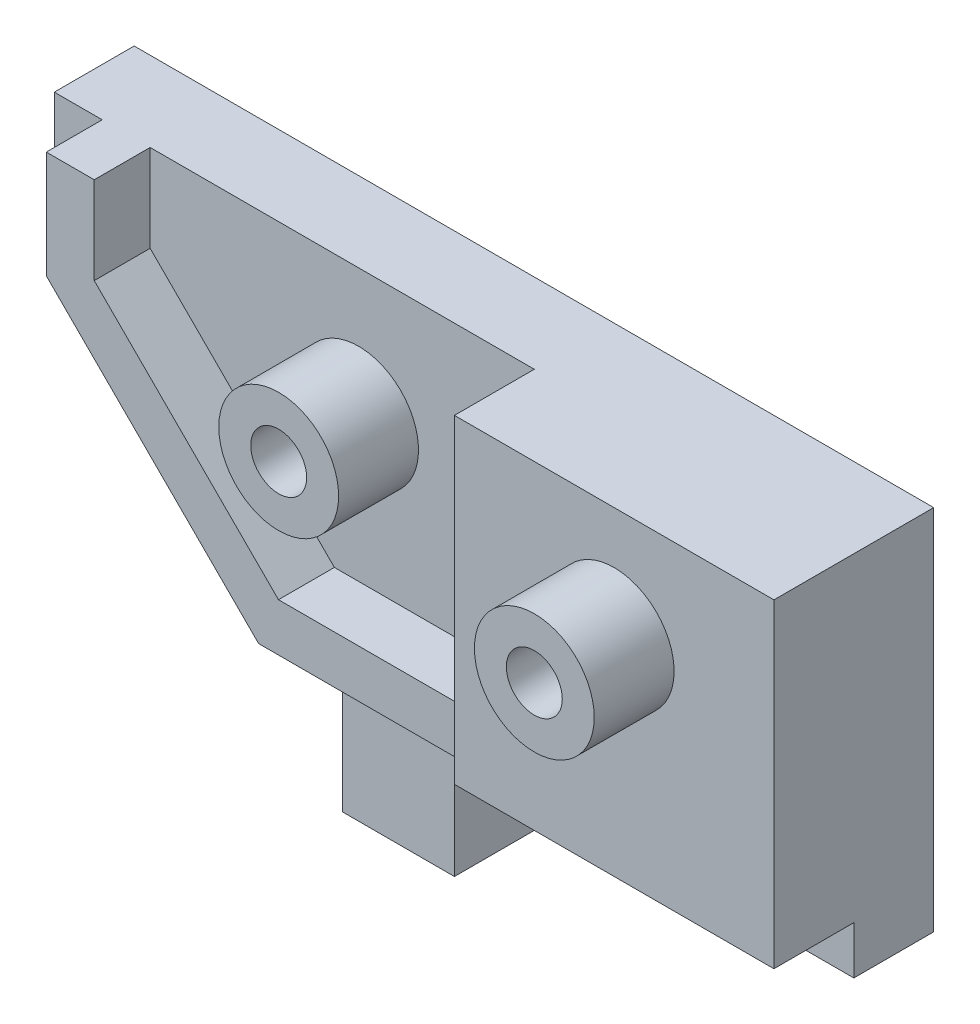
ISO-10303-21;
HEADER;
FILE_DESCRIPTION(('STEP AP214'),'2;1');
FILE_NAME('part.step','',(''),(''),'','','');
FILE_SCHEMA(('AUTOMOTIVE_DESIGN { 1 0 10303 214 1 1 1 1 }'));
ENDSEC;
DATA;
#1=APPLICATION_CONTEXT('core data for automotive mechanical design processes');
#2=APPLICATION_PROTOCOL_DEFINITION('international standard','automotive_design',2000,#1);
#3=PRODUCT_CONTEXT('',#1,'mechanical');
#4=PRODUCT('Part','Part','',(#3));
#5=PRODUCT_RELATED_PRODUCT_CATEGORY('part','',(#4));
#6=PRODUCT_DEFINITION_FORMATION('','',#4);
#7=PRODUCT_DEFINITION_CONTEXT('part definition',#1,'design');
#8=PRODUCT_DEFINITION('design','',#6,#7);
#9=PRODUCT_DEFINITION_SHAPE('','',#8);
#10=(LENGTH_UNIT() NAMED_UNIT(*) SI_UNIT(.MILLI.,.METRE.));
#11=(NAMED_UNIT(*) PLANE_ANGLE_UNIT() SI_UNIT($,.RADIAN.));
#12=(NAMED_UNIT(*) SI_UNIT($,.STERADIAN.) SOLID_ANGLE_UNIT());
#13=UNCERTAINTY_MEASURE_WITH_UNIT(LENGTH_MEASURE(1.E-05),#10,'distance_accuracy_value','');
#14=(GEOMETRIC_REPRESENTATION_CONTEXT(3) GLOBAL_UNCERTAINTY_ASSIGNED_CONTEXT((#13)) GLOBAL_UNIT_ASSIGNED_CONTEXT((#10,
#11,#12)) REPRESENTATION_CONTEXT('',''));
#15=CARTESIAN_POINT('',(0.,0.,0.));
#16=DIRECTION('',(0.,0.,1.));
#17=DIRECTION('',(1.,0.,0.));
#18=AXIS2_PLACEMENT_3D('',#15,#16,#17);
#19=CARTESIAN_POINT('',(0.,23.,5.));
#20=DIRECTION('',(0.,0.,-1.));
#21=DIRECTION('',(-1.,0.,0.));
#22=AXIS2_PLACEMENT_3D('',#19,#20,#21);
#23=PLANE('',#22);
#24=DIRECTION('',(0.,-1.,0.));
#25=VECTOR('',#24,1.);
#26=CARTESIAN_POINT('',(-12.0472323036498,23.,5.));
#27=LINE('',#26,#25);
#28=CARTESIAN_POINT('',(-12.0472323036498,23.,5.));
#29=VERTEX_POINT('',#28);
#30=CARTESIAN_POINT('',(-12.0472323036498,16.289872990769,5.));
#31=VERTEX_POINT('',#30);
#32=EDGE_CURVE('E813',#29,#31,#27,.T.);
#33=ORIENTED_EDGE('',*,*,#32,.F.);
#34=DIRECTION('',(1.,0.,0.));
#35=VECTOR('',#34,1.);
#36=CARTESIAN_POINT('',(0.,23.,5.));
#37=LINE('',#36,#35);
#38=CARTESIAN_POINT('',(-15.0472323036498,23.,5.));
#39=VERTEX_POINT('',#38);
#40=EDGE_CURVE('E243',#39,#29,#37,.T.);
#41=ORIENTED_EDGE('',*,*,#40,.F.);
#42=DIRECTION('',(0.,-1.,0.));
#43=VECTOR('',#42,1.);
#44=CARTESIAN_POINT('',(-15.0472323036498,23.,5.));
#45=LINE('',#44,#43);
#46=CARTESIAN_POINT('',(-15.0472323036498,15.0472323036497,5.));
#47=VERTEX_POINT('',#46);
#48=EDGE_CURVE('E423',#39,#47,#45,.T.);
#49=ORIENTED_EDGE('',*,*,#48,.T.);
#50=DIRECTION('',(0.707106781186549,-0.707106781186546,0.));
#51=VECTOR('',#50,1.);
#52=CARTESIAN_POINT('',(-15.0472323036498,15.0472323036497,5.));
#53=LINE('',#52,#51);
#54=CARTESIAN_POINT('',(0.,0.,5.));
#55=VERTEX_POINT('',#54);
#56=EDGE_CURVE('E429',#47,#55,#53,.T.);
#57=ORIENTED_EDGE('',*,*,#56,.T.);
#58=DIRECTION('',(1.,0.,0.));
#59=VECTOR('',#58,1.);
#60=CARTESIAN_POINT('',(0.,0.,5.));
#61=LINE('',#60,#59);
#62=CARTESIAN_POINT('',(3.,0.,5.));
#63=VERTEX_POINT('',#62);
#64=EDGE_CURVE('E265',#55,#63,#61,.T.);
#65=ORIENTED_EDGE('',*,*,#64,.T.);
#66=DIRECTION('',(0.,1.,0.));
#67=VECTOR('',#66,1.);
#68=CARTESIAN_POINT('',(3.,-7.,5.));
#69=LINE('',#68,#67);
#70=CARTESIAN_POINT('',(3.,-7.,5.));
#71=VERTEX_POINT('',#70);
#72=EDGE_CURVE('E311',#71,#63,#69,.T.);
#73=ORIENTED_EDGE('',*,*,#72,.F.);
#74=DIRECTION('',(-1.,0.,0.));
#75=VECTOR('',#74,1.);
#76=CARTESIAN_POINT('',(10.,-7.,5.));
#77=LINE('',#76,#75);
#78=CARTESIAN_POINT('',(10.,-7.,5.));
#79=VERTEX_POINT('',#78);
#80=EDGE_CURVE('E316',#79,#71,#77,.T.);
#81=ORIENTED_EDGE('',*,*,#80,.F.);
#82=DIRECTION('',(0.,1.,0.));
#83=VECTOR('',#82,1.);
#84=CARTESIAN_POINT('',(10.,-7.,5.));
#85=LINE('',#84,#83);
#86=CARTESIAN_POINT('',(10.,0.,5.));
#87=VERTEX_POINT('',#86);
#88=EDGE_CURVE('E315',#79,#87,#85,.T.);
#89=ORIENTED_EDGE('',*,*,#88,.T.);
#90=CARTESIAN_POINT('',(35.,0.,5.));
#91=VERTEX_POINT('',#90);
#92=EDGE_CURVE('E263',#87,#91,#61,.T.);
#93=ORIENTED_EDGE('',*,*,#92,.T.);
#94=DIRECTION('',(0.,1.,0.));
#95=VECTOR('',#94,1.);
#96=CARTESIAN_POINT('',(35.,3.,5.));
#97=LINE('',#96,#95);
#98=CARTESIAN_POINT('',(35.,3.,5.));
#99=VERTEX_POINT('',#98);
#100=EDGE_CURVE('E291',#91,#99,#97,.T.);
#101=ORIENTED_EDGE('',*,*,#100,.T.);
#102=DIRECTION('',(1.,0.,0.));
#103=VECTOR('',#102,1.);
#104=CARTESIAN_POINT('',(1.24264068711922,3.,5.));
#105=LINE('',#104,#103);
#106=CARTESIAN_POINT('',(1.24264068711922,3.,5.));
#107=VERTEX_POINT('',#106);
#108=EDGE_CURVE('E238',#107,#99,#105,.T.);
#109=ORIENTED_EDGE('',*,*,#108,.F.);
#110=DIRECTION('',(0.707106781186547,-0.707106781186547,0.));
#111=VECTOR('',#110,1.);
#112=CARTESIAN_POINT('',(-12.0472323036498,16.289872990769,5.));
#113=LINE('',#112,#111);
#114=EDGE_CURVE('E837',#31,#107,#113,.T.);
#115=ORIENTED_EDGE('',*,*,#114,.F.);
#116=EDGE_LOOP('',(#33,#41,#49,#57,#65,#73,#81,#89,#93,#101,#109,#115));
#117=FACE_BOUND('',#116,.T.);
#118=ADVANCED_FACE('F48',(#117),#23,.F.);
#119=CARTESIAN_POINT('',(4.,15.,5.));
#120=DIRECTION('',(0.,0.,-1.));
#121=DIRECTION('',(-1.,0.,0.));
#122=AXIS2_PLACEMENT_3D('',#119,#120,#121);
#123=CIRCLE('',#122,3.75);
#124=CARTESIAN_POINT('',(0.249999999999999,15.,5.));
#125=VERTEX_POINT('',#124);
#126=EDGE_CURVE('E56',#125,#125,#123,.F.);
#127=ORIENTED_EDGE('',*,*,#126,.F.);
#128=EDGE_LOOP('',(#127));
#129=FACE_BOUND('',#128,.T.);
#130=DIRECTION('',(-1.,0.,0.));
#131=VECTOR('',#130,1.);
#132=CARTESIAN_POINT('',(2.4852813742385,6.,5.));
#133=LINE('',#132,#131);
#134=CARTESIAN_POINT('',(15.,6.,5.));
#135=VERTEX_POINT('',#134);
#136=CARTESIAN_POINT('',(2.4852813742385,6.,5.));
#137=VERTEX_POINT('',#136);
#138=EDGE_CURVE('E230',#135,#137,#133,.T.);
#139=ORIENTED_EDGE('',*,*,#138,.F.);
#140=DIRECTION('',(0.,-1.,0.));
#141=VECTOR('',#140,1.);
#142=CARTESIAN_POINT('',(15.,23.,5.));
#143=LINE('',#142,#141);
#144=CARTESIAN_POINT('',(15.,23.,5.));
#145=VERTEX_POINT('',#144);
#146=EDGE_CURVE('E208',#145,#135,#143,.T.);
#147=ORIENTED_EDGE('',*,*,#146,.F.);
#148=CARTESIAN_POINT('',(-9.04723230364976,23.,5.));
#149=VERTEX_POINT('',#148);
#150=EDGE_CURVE('E250',#149,#145,#37,.T.);
#151=ORIENTED_EDGE('',*,*,#150,.F.);
#152=DIRECTION('',(0.,1.,0.));
#153=VECTOR('',#152,1.);
#154=CARTESIAN_POINT('',(-9.04723230364976,23.,5.));
#155=LINE('',#154,#153);
#156=CARTESIAN_POINT('',(-9.04723230364976,17.5325136778883,5.));
#157=VERTEX_POINT('',#156);
#158=EDGE_CURVE('E388',#157,#149,#155,.T.);
#159=ORIENTED_EDGE('',*,*,#158,.F.);
#160=DIRECTION('',(-0.707106781186547,0.707106781186547,0.));
#161=VECTOR('',#160,1.);
#162=CARTESIAN_POINT('',(-9.04723230364976,17.5325136778883,5.));
#163=LINE('',#162,#161);
#164=EDGE_CURVE('E233',#137,#157,#163,.T.);
#165=ORIENTED_EDGE('',*,*,#164,.F.);
#166=EDGE_LOOP('',(#139,#147,#151,#159,#165));
#167=FACE_BOUND('',#166,.T.);
#168=ADVANCED_FACE('F224',(#129,#167),#23,.F.);
#169=CARTESIAN_POINT('',(15.,23.,5.));
#170=DIRECTION('',(1.,0.,0.));
#171=DIRECTION('',(0.,0.,-1.));
#172=AXIS2_PLACEMENT_3D('',#169,#170,#171);
#173=PLANE('',#172);
#174=DIRECTION('',(0.,1.,0.));
#175=VECTOR('',#174,1.);
#176=CARTESIAN_POINT('',(15.,6.,8.5));
#177=LINE('',#176,#175);
#178=CARTESIAN_POINT('',(15.,3.,8.5));
#179=VERTEX_POINT('',#178);
#180=CARTESIAN_POINT('',(15.,6.,8.5));
#181=VERTEX_POINT('',#180);
#182=EDGE_CURVE('E201',#179,#181,#177,.T.);
#183=ORIENTED_EDGE('',*,*,#182,.F.);
#184=DIRECTION('',(0.,0.,-1.));
#185=VECTOR('',#184,1.);
#186=CARTESIAN_POINT('',(15.,3.,5.));
#187=LINE('',#186,#185);
#188=CARTESIAN_POINT('',(15.,3.,10.));
#189=VERTEX_POINT('',#188);
#190=EDGE_CURVE('E183',#189,#179,#187,.T.);
#191=ORIENTED_EDGE('',*,*,#190,.F.);
#192=DIRECTION('',(0.,-1.,0.));
#193=VECTOR('',#192,1.);
#194=CARTESIAN_POINT('',(15.,23.,10.));
#195=LINE('',#194,#193);
#196=CARTESIAN_POINT('',(15.,23.,10.));
#197=VERTEX_POINT('',#196);
#198=EDGE_CURVE('E198',#197,#189,#195,.T.);
#199=ORIENTED_EDGE('',*,*,#198,.F.);
#200=DIRECTION('',(0.,0.,1.));
#201=VECTOR('',#200,1.);
#202=CARTESIAN_POINT('',(15.,23.,5.));
#203=LINE('',#202,#201);
#204=EDGE_CURVE('E241',#145,#197,#203,.T.);
#205=ORIENTED_EDGE('',*,*,#204,.F.);
#206=ORIENTED_EDGE('',*,*,#146,.T.);
#207=DIRECTION('',(0.,0.,-1.));
#208=VECTOR('',#207,1.);
#209=CARTESIAN_POINT('',(15.,6.,8.5));
#210=LINE('',#209,#208);
#211=EDGE_CURVE('E240',#181,#135,#210,.T.);
#212=ORIENTED_EDGE('',*,*,#211,.F.);
#213=EDGE_LOOP('',(#183,#191,#199,#205,#206,#212));
#214=FACE_BOUND('',#213,.T.);
#215=ADVANCED_FACE('F196',(#214),#173,.F.);
#216=CARTESIAN_POINT('',(15.,23.,10.));
#217=DIRECTION('',(0.,0.,-1.));
#218=DIRECTION('',(-1.,0.,0.));
#219=AXIS2_PLACEMENT_3D('',#216,#217,#218);
#220=PLANE('',#219);
#221=ORIENTED_EDGE('',*,*,#198,.T.);
#222=DIRECTION('',(-1.,0.,0.));
#223=VECTOR('',#222,1.);
#224=CARTESIAN_POINT('',(40.8309518948453,3.,10.));
#225=LINE('',#224,#223);
#226=CARTESIAN_POINT('',(35.,3.,10.));
#227=VERTEX_POINT('',#226);
#228=EDGE_CURVE('E179',#227,#189,#225,.T.);
#229=ORIENTED_EDGE('',*,*,#228,.F.);
#230=DIRECTION('',(0.,-1.,0.));
#231=VECTOR('',#230,1.);
#232=CARTESIAN_POINT('',(35.,23.,10.));
#233=LINE('',#232,#231);
#234=CARTESIAN_POINT('',(35.,23.,10.));
#235=VERTEX_POINT('',#234);
#236=EDGE_CURVE('E209',#235,#227,#233,.T.);
#237=ORIENTED_EDGE('',*,*,#236,.F.);
#238=DIRECTION('',(1.,0.,0.));
#239=VECTOR('',#238,1.);
#240=CARTESIAN_POINT('',(15.,23.,10.));
#241=LINE('',#240,#239);
#242=EDGE_CURVE('E206',#197,#235,#241,.T.);
#243=ORIENTED_EDGE('',*,*,#242,.F.);
#244=EDGE_LOOP('',(#221,#229,#237,#243));
#245=FACE_BOUND('',#244,.T.);
#246=CARTESIAN_POINT('',(25.,16.,10.));
#247=DIRECTION('',(0.,0.,-1.));
#248=DIRECTION('',(-1.,0.,0.));
#249=AXIS2_PLACEMENT_3D('',#246,#247,#248);
#250=CIRCLE('',#249,3.75);
#251=CARTESIAN_POINT('',(21.25,16.,10.));
#252=VERTEX_POINT('',#251);
#253=EDGE_CURVE('E12',#252,#252,#250,.F.);
#254=ORIENTED_EDGE('',*,*,#253,.F.);
#255=EDGE_LOOP('',(#254));
#256=FACE_BOUND('',#255,.T.);
#257=ADVANCED_FACE('F204',(#245,#256),#220,.F.);
#258=CARTESIAN_POINT('',(0.,0.,0.));
#259=DIRECTION('',(0.,1.,0.));
#260=DIRECTION('',(0.,0.,1.));
#261=AXIS2_PLACEMENT_3D('',#258,#259,#260);
#262=PLANE('',#261);
#263=DIRECTION('',(0.,0.,-1.));
#264=VECTOR('',#263,1.);
#265=CARTESIAN_POINT('',(3.,0.,0.));
#266=LINE('',#265,#264);
#267=CARTESIAN_POINT('',(3.,0.,0.));
#268=VERTEX_POINT('',#267);
#269=EDGE_CURVE('E71',#63,#268,#266,.T.);
#270=ORIENTED_EDGE('',*,*,#269,.F.);
#271=ORIENTED_EDGE('',*,*,#64,.F.);
#272=DIRECTION('',(0.,0.,1.));
#273=VECTOR('',#272,1.);
#274=CARTESIAN_POINT('',(0.,0.,0.));
#275=LINE('',#274,#273);
#276=CARTESIAN_POINT('',(0.,0.,0.));
#277=VERTEX_POINT('',#276);
#278=EDGE_CURVE('E259',#277,#55,#275,.T.);
#279=ORIENTED_EDGE('',*,*,#278,.F.);
#280=DIRECTION('',(-1.,0.,0.));
#281=VECTOR('',#280,1.);
#282=CARTESIAN_POINT('',(0.,0.,0.));
#283=LINE('',#282,#281);
#284=EDGE_CURVE('E271',#268,#277,#283,.T.);
#285=ORIENTED_EDGE('',*,*,#284,.F.);
#286=EDGE_LOOP('',(#270,#271,#279,#285));
#287=FACE_BOUND('',#286,.T.);
#288=ADVANCED_FACE('F440',(#287),#262,.F.);
#289=CARTESIAN_POINT('',(25.,0.,2.5));
#290=DIRECTION('',(0.,-1.,0.));
#291=DIRECTION('',(0.,0.,-1.));
#292=AXIS2_PLACEMENT_3D('',#289,#290,#291);
#293=CIRCLE('',#292,1.75);
#294=CARTESIAN_POINT('',(25.,0.,0.75));
#295=VERTEX_POINT('',#294);
#296=EDGE_CURVE('E806',#295,#295,#293,.T.);
#297=ORIENTED_EDGE('',*,*,#296,.F.);
#298=EDGE_LOOP('',(#297));
#299=FACE_BOUND('',#298,.T.);
#300=DIRECTION('',(0.,0.,-1.));
#301=VECTOR('',#300,1.);
#302=CARTESIAN_POINT('',(35.,0.,5.));
#303=LINE('',#302,#301);
#304=CARTESIAN_POINT('',(35.,0.,0.));
#305=VERTEX_POINT('',#304);
#306=EDGE_CURVE('E268',#91,#305,#303,.T.);
#307=ORIENTED_EDGE('',*,*,#306,.F.);
#308=ORIENTED_EDGE('',*,*,#92,.F.);
#309=DIRECTION('',(0.,0.,1.));
#310=VECTOR('',#309,1.);
#311=CARTESIAN_POINT('',(10.,0.,0.));
#312=LINE('',#311,#310);
#313=CARTESIAN_POINT('',(10.,0.,0.));
#314=VERTEX_POINT('',#313);
#315=EDGE_CURVE('E295',#314,#87,#312,.T.);
#316=ORIENTED_EDGE('',*,*,#315,.F.);
#317=EDGE_CURVE('E272',#305,#314,#283,.T.);
#318=ORIENTED_EDGE('',*,*,#317,.F.);
#319=EDGE_LOOP('',(#307,#308,#316,#318));
#320=FACE_BOUND('',#319,.T.);
#321=ADVANCED_FACE('F293',(#299,#320),#262,.F.);
#322=CARTESIAN_POINT('',(35.,23.,5.));
#323=DIRECTION('',(-1.,0.,0.));
#324=DIRECTION('',(0.,0.,1.));
#325=AXIS2_PLACEMENT_3D('',#322,#323,#324);
#326=PLANE('',#325);
#327=DIRECTION('',(0.,0.,1.));
#328=VECTOR('',#327,1.);
#329=CARTESIAN_POINT('',(35.,3.,5.));
#330=LINE('',#329,#328);
#331=EDGE_CURVE('E186',#99,#227,#330,.T.);
#332=ORIENTED_EDGE('',*,*,#331,.F.);
#333=ORIENTED_EDGE('',*,*,#100,.F.);
#334=ORIENTED_EDGE('',*,*,#306,.T.);
#335=DIRECTION('',(0.,-1.,0.));
#336=VECTOR('',#335,1.);
#337=CARTESIAN_POINT('',(35.,23.,0.));
#338=LINE('',#337,#336);
#339=CARTESIAN_POINT('',(35.,23.,0.));
#340=VERTEX_POINT('',#339);
#341=EDGE_CURVE('E215',#340,#305,#338,.T.);
#342=ORIENTED_EDGE('',*,*,#341,.F.);
#343=DIRECTION('',(0.,0.,-1.));
#344=VECTOR('',#343,1.);
#345=CARTESIAN_POINT('',(35.,23.,5.));
#346=LINE('',#345,#344);
#347=EDGE_CURVE('E247',#235,#340,#346,.T.);
#348=ORIENTED_EDGE('',*,*,#347,.F.);
#349=ORIENTED_EDGE('',*,*,#236,.T.);
#350=EDGE_LOOP('',(#332,#333,#334,#342,#348,#349));
#351=FACE_BOUND('',#350,.T.);
#352=ADVANCED_FACE('F287',(#351),#326,.F.);
#353=CARTESIAN_POINT('',(0.,23.,0.));
#354=DIRECTION('',(0.,0.,1.));
#355=DIRECTION('',(1.,0.,0.));
#356=AXIS2_PLACEMENT_3D('',#353,#354,#355);
#357=PLANE('',#356);
#358=CARTESIAN_POINT('',(4.,15.,0.));
#359=DIRECTION('',(0.,0.,1.));
#360=DIRECTION('',(1.,0.,0.));
#361=AXIS2_PLACEMENT_3D('',#358,#359,#360);
#362=CIRCLE('',#361,1.75);
#363=CARTESIAN_POINT('',(5.75,15.,0.));
#364=VERTEX_POINT('',#363);
#365=EDGE_CURVE('E264',#364,#364,#362,.T.);
#366=ORIENTED_EDGE('',*,*,#365,.T.);
#367=EDGE_LOOP('',(#366));
#368=FACE_BOUND('',#367,.T.);
#369=CARTESIAN_POINT('',(25.,16.,0.));
#370=DIRECTION('',(0.,0.,1.));
#371=DIRECTION('',(1.,0.,0.));
#372=AXIS2_PLACEMENT_3D('',#369,#370,#371);
#373=CIRCLE('',#372,1.75);
#374=CARTESIAN_POINT('',(26.75,16.,0.));
#375=VERTEX_POINT('',#374);
#376=EDGE_CURVE('E326',#375,#375,#373,.T.);
#377=ORIENTED_EDGE('',*,*,#376,.T.);
#378=EDGE_LOOP('',(#377));
#379=FACE_BOUND('',#378,.T.);
#380=ORIENTED_EDGE('',*,*,#317,.T.);
#381=DIRECTION('',(0.,1.,0.));
#382=VECTOR('',#381,1.);
#383=CARTESIAN_POINT('',(10.,-7.,0.));
#384=LINE('',#383,#382);
#385=CARTESIAN_POINT('',(10.,-7.,0.));
#386=VERTEX_POINT('',#385);
#387=EDGE_CURVE('E319',#386,#314,#384,.T.);
#388=ORIENTED_EDGE('',*,*,#387,.F.);
#389=DIRECTION('',(1.,0.,0.));
#390=VECTOR('',#389,1.);
#391=CARTESIAN_POINT('',(10.,-7.,0.));
#392=LINE('',#391,#390);
#393=CARTESIAN_POINT('',(3.,-7.,0.));
#394=VERTEX_POINT('',#393);
#395=EDGE_CURVE('E305',#394,#386,#392,.T.);
#396=ORIENTED_EDGE('',*,*,#395,.F.);
#397=DIRECTION('',(0.,1.,0.));
#398=VECTOR('',#397,1.);
#399=CARTESIAN_POINT('',(3.,-7.,0.));
#400=LINE('',#399,#398);
#401=EDGE_CURVE('E322',#394,#268,#400,.T.);
#402=ORIENTED_EDGE('',*,*,#401,.T.);
#403=ORIENTED_EDGE('',*,*,#284,.T.);
#404=DIRECTION('',(0.707106781186549,-0.707106781186546,0.));
#405=VECTOR('',#404,1.);
#406=CARTESIAN_POINT('',(-15.0472323036498,15.0472323036497,0.));
#407=LINE('',#406,#405);
#408=CARTESIAN_POINT('',(-15.0472323036498,15.0472323036497,0.));
#409=VERTEX_POINT('',#408);
#410=EDGE_CURVE('E428',#409,#277,#407,.T.);
#411=ORIENTED_EDGE('',*,*,#410,.F.);
#412=DIRECTION('',(0.,-1.,0.));
#413=VECTOR('',#412,1.);
#414=CARTESIAN_POINT('',(-15.0472323036498,23.,0.));
#415=LINE('',#414,#413);
#416=CARTESIAN_POINT('',(-15.0472323036498,23.,0.));
#417=VERTEX_POINT('',#416);
#418=EDGE_CURVE('E424',#417,#409,#415,.T.);
#419=ORIENTED_EDGE('',*,*,#418,.F.);
#420=DIRECTION('',(-1.,0.,0.));
#421=VECTOR('',#420,1.);
#422=CARTESIAN_POINT('',(35.,23.,0.));
#423=LINE('',#422,#421);
#424=EDGE_CURVE('E256',#340,#417,#423,.T.);
#425=ORIENTED_EDGE('',*,*,#424,.F.);
#426=ORIENTED_EDGE('',*,*,#341,.T.);
#427=EDGE_LOOP('',(#380,#388,#396,#402,#403,#411,#419,#425,#426));
#428=FACE_BOUND('',#427,.T.);
#429=ADVANCED_FACE('F280',(#368,#379,#428),#357,.F.);
#430=CARTESIAN_POINT('',(0.,23.,0.));
#431=DIRECTION('',(0.,1.,0.));
#432=DIRECTION('',(0.,0.,1.));
#433=AXIS2_PLACEMENT_3D('',#430,#431,#432);
#434=PLANE('',#433);
#435=ORIENTED_EDGE('',*,*,#424,.T.);
#436=DIRECTION('',(0.,0.,1.));
#437=VECTOR('',#436,1.);
#438=CARTESIAN_POINT('',(-15.0472323036498,23.,0.));
#439=LINE('',#438,#437);
#440=EDGE_CURVE('E353',#417,#39,#439,.T.);
#441=ORIENTED_EDGE('',*,*,#440,.T.);
#442=ORIENTED_EDGE('',*,*,#40,.T.);
#443=DIRECTION('',(0.,0.,-1.));
#444=VECTOR('',#443,1.);
#445=CARTESIAN_POINT('',(-12.0472323036498,23.,8.5));
#446=LINE('',#445,#444);
#447=CARTESIAN_POINT('',(-12.0472323036498,23.,8.5));
#448=VERTEX_POINT('',#447);
#449=EDGE_CURVE('E420',#448,#29,#446,.T.);
#450=ORIENTED_EDGE('',*,*,#449,.F.);
#451=DIRECTION('',(-1.,0.,0.));
#452=VECTOR('',#451,1.);
#453=CARTESIAN_POINT('',(-12.0472323036498,23.,8.5));
#454=LINE('',#453,#452);
#455=CARTESIAN_POINT('',(-9.04723230364976,23.,8.5));
#456=VERTEX_POINT('',#455);
#457=EDGE_CURVE('E392',#456,#448,#454,.T.);
#458=ORIENTED_EDGE('',*,*,#457,.F.);
#459=DIRECTION('',(0.,0.,-1.));
#460=VECTOR('',#459,1.);
#461=CARTESIAN_POINT('',(-9.04723230364976,23.,8.5));
#462=LINE('',#461,#460);
#463=EDGE_CURVE('E63',#456,#149,#462,.T.);
#464=ORIENTED_EDGE('',*,*,#463,.T.);
#465=ORIENTED_EDGE('',*,*,#150,.T.);
#466=ORIENTED_EDGE('',*,*,#204,.T.);
#467=ORIENTED_EDGE('',*,*,#242,.T.);
#468=ORIENTED_EDGE('',*,*,#347,.T.);
#469=EDGE_LOOP('',(#435,#441,#442,#450,#458,#464,#465,#466,#467,#468));
#470=FACE_BOUND('',#469,.T.);
#471=ADVANCED_FACE('F338',(#470),#434,.T.);
#472=CARTESIAN_POINT('',(25.,16.,0.));
#473=DIRECTION('',(0.,0.,1.));
#474=DIRECTION('',(1.,0.,0.));
#475=AXIS2_PLACEMENT_3D('',#472,#473,#474);
#476=CYLINDRICAL_SURFACE('',#475,1.75);
#477=ORIENTED_EDGE('',*,*,#376,.F.);
#478=EDGE_LOOP('',(#477));
#479=FACE_BOUND('',#478,.T.);
#480=CARTESIAN_POINT('',(25.,16.,15.));
#481=DIRECTION('',(0.,0.,1.));
#482=DIRECTION('',(1.,0.,0.));
#483=AXIS2_PLACEMENT_3D('',#480,#481,#482);
#484=CIRCLE('',#483,1.75);
#485=CARTESIAN_POINT('',(26.75,16.,15.));
#486=VERTEX_POINT('',#485);
#487=EDGE_CURVE('E342',#486,#486,#484,.T.);
#488=ORIENTED_EDGE('',*,*,#487,.T.);
#489=EDGE_LOOP('',(#488));
#490=FACE_BOUND('',#489,.T.);
#491=ADVANCED_FACE('F334',(#479,#490),#476,.F.);
#492=CARTESIAN_POINT('',(4.,15.,0.));
#493=DIRECTION('',(0.,0.,1.));
#494=DIRECTION('',(1.,0.,0.));
#495=AXIS2_PLACEMENT_3D('',#492,#493,#494);
#496=CYLINDRICAL_SURFACE('',#495,1.75);
#497=ORIENTED_EDGE('',*,*,#365,.F.);
#498=EDGE_LOOP('',(#497));
#499=FACE_BOUND('',#498,.T.);
#500=CARTESIAN_POINT('',(4.,15.,10.));
#501=DIRECTION('',(0.,0.,1.));
#502=DIRECTION('',(1.,0.,0.));
#503=AXIS2_PLACEMENT_3D('',#500,#501,#502);
#504=CIRCLE('',#503,1.75);
#505=CARTESIAN_POINT('',(5.75,15.,10.));
#506=VERTEX_POINT('',#505);
#507=EDGE_CURVE('E351',#506,#506,#504,.T.);
#508=ORIENTED_EDGE('',*,*,#507,.T.);
#509=EDGE_LOOP('',(#508));
#510=FACE_BOUND('',#509,.T.);
#511=ADVANCED_FACE('F337',(#499,#510),#496,.F.);
#512=CARTESIAN_POINT('',(3.,-7.,0.));
#513=DIRECTION('',(1.,0.,0.));
#514=DIRECTION('',(0.,0.,-1.));
#515=AXIS2_PLACEMENT_3D('',#512,#513,#514);
#516=PLANE('',#515);
#517=ORIENTED_EDGE('',*,*,#269,.T.);
#518=ORIENTED_EDGE('',*,*,#401,.F.);
#519=DIRECTION('',(0.,0.,-1.));
#520=VECTOR('',#519,1.);
#521=CARTESIAN_POINT('',(3.,-7.,0.));
#522=LINE('',#521,#520);
#523=EDGE_CURVE('E300',#71,#394,#522,.T.);
#524=ORIENTED_EDGE('',*,*,#523,.F.);
#525=ORIENTED_EDGE('',*,*,#72,.T.);
#526=EDGE_LOOP('',(#517,#518,#524,#525));
#527=FACE_BOUND('',#526,.T.);
#528=ADVANCED_FACE('F379',(#527),#516,.F.);
#529=CARTESIAN_POINT('',(10.,-7.,0.));
#530=DIRECTION('',(-1.,0.,0.));
#531=DIRECTION('',(0.,0.,1.));
#532=AXIS2_PLACEMENT_3D('',#529,#530,#531);
#533=PLANE('',#532);
#534=ORIENTED_EDGE('',*,*,#315,.T.);
#535=ORIENTED_EDGE('',*,*,#88,.F.);
#536=DIRECTION('',(0.,0.,1.));
#537=VECTOR('',#536,1.);
#538=CARTESIAN_POINT('',(10.,-7.,0.));
#539=LINE('',#538,#537);
#540=EDGE_CURVE('E365',#386,#79,#539,.T.);
#541=ORIENTED_EDGE('',*,*,#540,.F.);
#542=ORIENTED_EDGE('',*,*,#387,.T.);
#543=EDGE_LOOP('',(#534,#535,#541,#542));
#544=FACE_BOUND('',#543,.T.);
#545=ADVANCED_FACE('F383',(#544),#533,.F.);
#546=CARTESIAN_POINT('',(0.,-7.,0.));
#547=DIRECTION('',(0.,-1.,0.));
#548=DIRECTION('',(0.,0.,-1.));
#549=AXIS2_PLACEMENT_3D('',#546,#547,#548);
#550=PLANE('',#549);
#551=ORIENTED_EDGE('',*,*,#523,.T.);
#552=ORIENTED_EDGE('',*,*,#395,.T.);
#553=ORIENTED_EDGE('',*,*,#540,.T.);
#554=ORIENTED_EDGE('',*,*,#80,.T.);
#555=EDGE_LOOP('',(#551,#552,#553,#554));
#556=FACE_BOUND('',#555,.T.);
#557=ADVANCED_FACE('F371',(#556),#550,.T.);
#558=CARTESIAN_POINT('',(4.,15.,10.));
#559=DIRECTION('',(0.,0.,1.));
#560=DIRECTION('',(1.,0.,0.));
#561=AXIS2_PLACEMENT_3D('',#558,#559,#560);
#562=PLANE('',#561);
#563=CARTESIAN_POINT('',(4.,15.,10.));
#564=DIRECTION('',(0.,0.,1.));
#565=DIRECTION('',(1.,0.,0.));
#566=AXIS2_PLACEMENT_3D('',#563,#564,#565);
#567=CIRCLE('',#566,3.75);
#568=CARTESIAN_POINT('',(7.75,15.,10.));
#569=VERTEX_POINT('',#568);
#570=EDGE_CURVE('E307',#569,#569,#567,.T.);
#571=ORIENTED_EDGE('',*,*,#570,.T.);
#572=EDGE_LOOP('',(#571));
#573=FACE_BOUND('',#572,.T.);
#574=ORIENTED_EDGE('',*,*,#507,.F.);
#575=EDGE_LOOP('',(#574));
#576=FACE_BOUND('',#575,.T.);
#577=ADVANCED_FACE('F652',(#573,#576),#562,.T.);
#578=CARTESIAN_POINT('',(4.,15.,10.));
#579=DIRECTION('',(0.,0.,-1.));
#580=DIRECTION('',(-1.,0.,0.));
#581=AXIS2_PLACEMENT_3D('',#578,#579,#580);
#582=CYLINDRICAL_SURFACE('',#581,3.75);
#583=ORIENTED_EDGE('',*,*,#570,.F.);
#584=EDGE_LOOP('',(#583));
#585=FACE_BOUND('',#584,.T.);
#586=ORIENTED_EDGE('',*,*,#126,.T.);
#587=EDGE_LOOP('',(#586));
#588=FACE_BOUND('',#587,.T.);
#589=ADVANCED_FACE('F222',(#585,#588),#582,.T.);
#590=CARTESIAN_POINT('',(25.,16.,15.));
#591=DIRECTION('',(0.,0.,1.));
#592=DIRECTION('',(1.,0.,0.));
#593=AXIS2_PLACEMENT_3D('',#590,#591,#592);
#594=PLANE('',#593);
#595=CARTESIAN_POINT('',(25.,16.,15.));
#596=DIRECTION('',(0.,0.,1.));
#597=DIRECTION('',(1.,0.,0.));
#598=AXIS2_PLACEMENT_3D('',#595,#596,#597);
#599=CIRCLE('',#598,3.75);
#600=CARTESIAN_POINT('',(28.75,16.,15.));
#601=VERTEX_POINT('',#600);
#602=EDGE_CURVE('E345',#601,#601,#599,.T.);
#603=ORIENTED_EDGE('',*,*,#602,.T.);
#604=EDGE_LOOP('',(#603));
#605=FACE_BOUND('',#604,.T.);
#606=ORIENTED_EDGE('',*,*,#487,.F.);
#607=EDGE_LOOP('',(#606));
#608=FACE_BOUND('',#607,.T.);
#609=ADVANCED_FACE('F664',(#605,#608),#594,.T.);
#610=CARTESIAN_POINT('',(25.,16.,15.));
#611=DIRECTION('',(0.,0.,-1.));
#612=DIRECTION('',(-1.,0.,0.));
#613=AXIS2_PLACEMENT_3D('',#610,#611,#612);
#614=CYLINDRICAL_SURFACE('',#613,3.75);
#615=ORIENTED_EDGE('',*,*,#602,.F.);
#616=EDGE_LOOP('',(#615));
#617=FACE_BOUND('',#616,.T.);
#618=ORIENTED_EDGE('',*,*,#253,.T.);
#619=EDGE_LOOP('',(#618));
#620=FACE_BOUND('',#619,.T.);
#621=ADVANCED_FACE('F671',(#617,#620),#614,.T.);
#622=CARTESIAN_POINT('',(-15.0472323036498,15.0472323036497,0.));
#623=DIRECTION('',(-0.707106781186546,-0.707106781186549,0.));
#624=DIRECTION('',(0.707106781186549,-0.707106781186546,0.));
#625=AXIS2_PLACEMENT_3D('',#622,#623,#624);
#626=PLANE('',#625);
#627=ORIENTED_EDGE('',*,*,#56,.F.);
#628=DIRECTION('',(0.,0.,1.));
#629=VECTOR('',#628,1.);
#630=CARTESIAN_POINT('',(-15.0472323036498,15.0472323036497,0.));
#631=LINE('',#630,#629);
#632=EDGE_CURVE('E346',#409,#47,#631,.T.);
#633=ORIENTED_EDGE('',*,*,#632,.F.);
#634=ORIENTED_EDGE('',*,*,#410,.T.);
#635=ORIENTED_EDGE('',*,*,#278,.T.);
#636=EDGE_LOOP('',(#627,#633,#634,#635));
#637=FACE_BOUND('',#636,.T.);
#638=ADVANCED_FACE('F439',(#637),#626,.T.);
#639=CARTESIAN_POINT('',(-15.0472323036498,23.,0.));
#640=DIRECTION('',(-1.,0.,0.));
#641=DIRECTION('',(0.,0.,1.));
#642=AXIS2_PLACEMENT_3D('',#639,#640,#641);
#643=PLANE('',#642);
#644=ORIENTED_EDGE('',*,*,#48,.F.);
#645=ORIENTED_EDGE('',*,*,#440,.F.);
#646=ORIENTED_EDGE('',*,*,#418,.T.);
#647=ORIENTED_EDGE('',*,*,#632,.T.);
#648=EDGE_LOOP('',(#644,#645,#646,#647));
#649=FACE_BOUND('',#648,.T.);
#650=ADVANCED_FACE('F564',(#649),#643,.T.);
#651=CARTESIAN_POINT('',(-12.0472323036498,23.,8.5));
#652=DIRECTION('',(1.,0.,0.));
#653=DIRECTION('',(0.,0.,-1.));
#654=AXIS2_PLACEMENT_3D('',#651,#652,#653);
#655=PLANE('',#654);
#656=ORIENTED_EDGE('',*,*,#32,.T.);
#657=DIRECTION('',(0.,0.,-1.));
#658=VECTOR('',#657,1.);
#659=CARTESIAN_POINT('',(-12.0472323036498,16.289872990769,8.5));
#660=LINE('',#659,#658);
#661=CARTESIAN_POINT('',(-12.0472323036498,16.289872990769,8.5));
#662=VERTEX_POINT('',#661);
#663=EDGE_CURVE('E416',#662,#31,#660,.T.);
#664=ORIENTED_EDGE('',*,*,#663,.F.);
#665=DIRECTION('',(0.,-1.,0.));
#666=VECTOR('',#665,1.);
#667=CARTESIAN_POINT('',(-12.0472323036498,23.,8.5));
#668=LINE('',#667,#666);
#669=EDGE_CURVE('E397',#448,#662,#668,.T.);
#670=ORIENTED_EDGE('',*,*,#669,.F.);
#671=ORIENTED_EDGE('',*,*,#449,.T.);
#672=EDGE_LOOP('',(#656,#664,#670,#671));
#673=FACE_BOUND('',#672,.T.);
#674=ADVANCED_FACE('F559',(#673),#655,.F.);
#675=CARTESIAN_POINT('',(-12.0472323036498,16.289872990769,8.5));
#676=DIRECTION('',(0.707106781186548,0.707106781186548,0.));
#677=DIRECTION('',(-0.707106781186548,0.707106781186548,0.));
#678=AXIS2_PLACEMENT_3D('',#675,#676,#677);
#679=PLANE('',#678);
#680=ORIENTED_EDGE('',*,*,#114,.T.);
#681=DIRECTION('',(0.,0.,-1.));
#682=VECTOR('',#681,1.);
#683=CARTESIAN_POINT('',(1.24264068711922,3.,8.5));
#684=LINE('',#683,#682);
#685=CARTESIAN_POINT('',(1.24264068711922,3.,8.5));
#686=VERTEX_POINT('',#685);
#687=EDGE_CURVE('E412',#686,#107,#684,.T.);
#688=ORIENTED_EDGE('',*,*,#687,.F.);
#689=DIRECTION('',(0.707106781186547,-0.707106781186547,0.));
#690=VECTOR('',#689,1.);
#691=CARTESIAN_POINT('',(-12.0472323036498,16.289872990769,8.5));
#692=LINE('',#691,#690);
#693=EDGE_CURVE('E819',#662,#686,#692,.T.);
#694=ORIENTED_EDGE('',*,*,#693,.F.);
#695=ORIENTED_EDGE('',*,*,#663,.T.);
#696=EDGE_LOOP('',(#680,#688,#694,#695));
#697=FACE_BOUND('',#696,.T.);
#698=ADVANCED_FACE('F501',(#697),#679,.F.);
#699=CARTESIAN_POINT('',(1.24264068711922,3.,8.5));
#700=DIRECTION('',(0.,1.,0.));
#701=DIRECTION('',(-1.,0.,0.));
#702=AXIS2_PLACEMENT_3D('',#699,#700,#701);
#703=PLANE('',#702);
#704=ORIENTED_EDGE('',*,*,#108,.T.);
#705=ORIENTED_EDGE('',*,*,#331,.T.);
#706=ORIENTED_EDGE('',*,*,#228,.T.);
#707=ORIENTED_EDGE('',*,*,#190,.T.);
#708=DIRECTION('',(1.,0.,0.));
#709=VECTOR('',#708,1.);
#710=CARTESIAN_POINT('',(1.24264068711922,3.,8.5));
#711=LINE('',#710,#709);
#712=EDGE_CURVE('E822',#686,#179,#711,.T.);
#713=ORIENTED_EDGE('',*,*,#712,.F.);
#714=ORIENTED_EDGE('',*,*,#687,.T.);
#715=EDGE_LOOP('',(#704,#705,#706,#707,#713,#714));
#716=FACE_BOUND('',#715,.T.);
#717=ADVANCED_FACE('F181',(#716),#703,.F.);
#718=CARTESIAN_POINT('',(2.4852813742385,6.,8.5));
#719=DIRECTION('',(0.,-1.,0.));
#720=DIRECTION('',(0.,0.,-1.));
#721=AXIS2_PLACEMENT_3D('',#718,#719,#720);
#722=PLANE('',#721);
#723=ORIENTED_EDGE('',*,*,#138,.T.);
#724=DIRECTION('',(0.,0.,-1.));
#725=VECTOR('',#724,1.);
#726=CARTESIAN_POINT('',(2.4852813742385,6.,8.5));
#727=LINE('',#726,#725);
#728=CARTESIAN_POINT('',(2.4852813742385,6.,8.5));
#729=VERTEX_POINT('',#728);
#730=EDGE_CURVE('E407',#729,#137,#727,.T.);
#731=ORIENTED_EDGE('',*,*,#730,.F.);
#732=DIRECTION('',(-1.,0.,0.));
#733=VECTOR('',#732,1.);
#734=CARTESIAN_POINT('',(2.4852813742385,6.,8.5));
#735=LINE('',#734,#733);
#736=EDGE_CURVE('E827',#181,#729,#735,.T.);
#737=ORIENTED_EDGE('',*,*,#736,.F.);
#738=ORIENTED_EDGE('',*,*,#211,.T.);
#739=EDGE_LOOP('',(#723,#731,#737,#738));
#740=FACE_BOUND('',#739,.T.);
#741=ADVANCED_FACE('F500',(#740),#722,.F.);
#742=CARTESIAN_POINT('',(-9.04723230364976,17.5325136778883,8.5));
#743=DIRECTION('',(-0.707106781186548,-0.707106781186547,0.));
#744=DIRECTION('',(0.707106781186547,-0.707106781186548,0.));
#745=AXIS2_PLACEMENT_3D('',#742,#743,#744);
#746=PLANE('',#745);
#747=ORIENTED_EDGE('',*,*,#164,.T.);
#748=DIRECTION('',(0.,0.,-1.));
#749=VECTOR('',#748,1.);
#750=CARTESIAN_POINT('',(-9.04723230364976,17.5325136778883,8.5));
#751=LINE('',#750,#749);
#752=CARTESIAN_POINT('',(-9.04723230364976,17.5325136778883,8.5));
#753=VERTEX_POINT('',#752);
#754=EDGE_CURVE('E403',#753,#157,#751,.T.);
#755=ORIENTED_EDGE('',*,*,#754,.F.);
#756=DIRECTION('',(-0.707106781186547,0.707106781186547,0.));
#757=VECTOR('',#756,1.);
#758=CARTESIAN_POINT('',(-9.04723230364976,17.5325136778883,8.5));
#759=LINE('',#758,#757);
#760=EDGE_CURVE('E830',#729,#753,#759,.T.);
#761=ORIENTED_EDGE('',*,*,#760,.F.);
#762=ORIENTED_EDGE('',*,*,#730,.T.);
#763=EDGE_LOOP('',(#747,#755,#761,#762));
#764=FACE_BOUND('',#763,.T.);
#765=ADVANCED_FACE('F585',(#764),#746,.F.);
#766=CARTESIAN_POINT('',(-9.04723230364976,23.,8.5));
#767=DIRECTION('',(-1.,0.,0.));
#768=DIRECTION('',(0.,0.,1.));
#769=AXIS2_PLACEMENT_3D('',#766,#767,#768);
#770=PLANE('',#769);
#771=ORIENTED_EDGE('',*,*,#158,.T.);
#772=ORIENTED_EDGE('',*,*,#463,.F.);
#773=DIRECTION('',(0.,1.,0.));
#774=VECTOR('',#773,1.);
#775=CARTESIAN_POINT('',(-9.04723230364976,23.,8.5));
#776=LINE('',#775,#774);
#777=EDGE_CURVE('E404',#753,#456,#776,.T.);
#778=ORIENTED_EDGE('',*,*,#777,.F.);
#779=ORIENTED_EDGE('',*,*,#754,.T.);
#780=EDGE_LOOP('',(#771,#772,#778,#779));
#781=FACE_BOUND('',#780,.T.);
#782=ADVANCED_FACE('F514',(#781),#770,.F.);
#783=CARTESIAN_POINT('',(0.,0.,8.5));
#784=DIRECTION('',(0.,0.,-1.));
#785=DIRECTION('',(-1.,0.,0.));
#786=AXIS2_PLACEMENT_3D('',#783,#784,#785);
#787=PLANE('',#786);
#788=ORIENTED_EDGE('',*,*,#457,.T.);
#789=ORIENTED_EDGE('',*,*,#669,.T.);
#790=ORIENTED_EDGE('',*,*,#693,.T.);
#791=ORIENTED_EDGE('',*,*,#712,.T.);
#792=ORIENTED_EDGE('',*,*,#182,.T.);
#793=ORIENTED_EDGE('',*,*,#736,.T.);
#794=ORIENTED_EDGE('',*,*,#760,.T.);
#795=ORIENTED_EDGE('',*,*,#777,.T.);
#796=EDGE_LOOP('',(#788,#789,#790,#791,#792,#793,#794,#795));
#797=FACE_BOUND('',#796,.T.);
#798=ADVANCED_FACE('F509',(#797),#787,.F.);
#799=CARTESIAN_POINT('',(25.,10.,2.5));
#800=DIRECTION('',(0.,-1.,0.));
#801=DIRECTION('',(0.,0.,-1.));
#802=AXIS2_PLACEMENT_3D('',#799,#800,#801);
#803=CYLINDRICAL_SURFACE('',#802,1.75);
#804=CARTESIAN_POINT('',(25.,10.,2.5));
#805=DIRECTION('',(0.,-1.,0.));
#806=DIRECTION('',(0.,0.,-1.));
#807=AXIS2_PLACEMENT_3D('',#804,#805,#806);
#808=CIRCLE('',#807,1.75);
#809=CARTESIAN_POINT('',(25.,10.,0.75));
#810=VERTEX_POINT('',#809);
#811=EDGE_CURVE('E809',#810,#810,#808,.T.);
#812=ORIENTED_EDGE('',*,*,#811,.F.);
#813=EDGE_LOOP('',(#812));
#814=FACE_BOUND('',#813,.T.);
#815=ORIENTED_EDGE('',*,*,#296,.T.);
#816=EDGE_LOOP('',(#815));
#817=FACE_BOUND('',#816,.T.);
#818=ADVANCED_FACE('F513',(#814,#817),#803,.F.);
#819=CARTESIAN_POINT('',(25.,10.,2.5));
#820=DIRECTION('',(0.,-1.,0.));
#821=DIRECTION('',(0.,0.,-1.));
#822=AXIS2_PLACEMENT_3D('',#819,#820,#821);
#823=PLANE('',#822);
#824=ORIENTED_EDGE('',*,*,#811,.T.);
#825=EDGE_LOOP('',(#824));
#826=FACE_BOUND('',#825,.T.);
#827=ADVANCED_FACE('F531',(#826),#823,.T.);
#828=CLOSED_SHELL('',(#118,#168,#215,#257,#288,#321,#352,#429,#471,#491,#511,#528,#545,#557,
#577,#589,#609,#621,#638,#650,#674,#698,#717,#741,#765,#782,#798,#818,#827));
#829=MANIFOLD_SOLID_BREP('B2',#828);
#830=ADVANCED_BREP_SHAPE_REPRESENTATION('',(#18,#829),#14);
#831=SHAPE_DEFINITION_REPRESENTATION(#9,#830);
ENDSEC;
END-ISO-10303-21;
